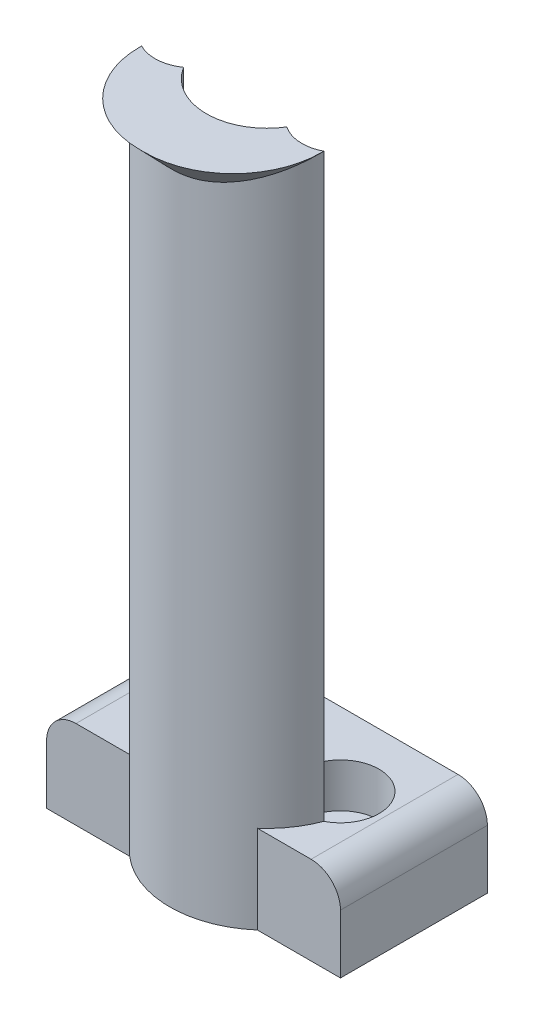
ISO-10303-21;
HEADER;
FILE_DESCRIPTION(('STEP AP214'),'2;1');
FILE_NAME('part.step','',(''),(''),'','','');
FILE_SCHEMA(('AUTOMOTIVE_DESIGN { 1 0 10303 214 1 1 1 1 }'));
ENDSEC;
DATA;
#1=APPLICATION_CONTEXT('core data for automotive mechanical design processes');
#2=APPLICATION_PROTOCOL_DEFINITION('international standard','automotive_design',2000,#1);
#3=PRODUCT_CONTEXT('',#1,'mechanical');
#4=PRODUCT('Part','Part','',(#3));
#5=PRODUCT_RELATED_PRODUCT_CATEGORY('part','',(#4));
#6=PRODUCT_DEFINITION_FORMATION('','',#4);
#7=PRODUCT_DEFINITION_CONTEXT('part definition',#1,'design');
#8=PRODUCT_DEFINITION('design','',#6,#7);
#9=PRODUCT_DEFINITION_SHAPE('','',#8);
#10=(LENGTH_UNIT() NAMED_UNIT(*) SI_UNIT(.MILLI.,.METRE.));
#11=(NAMED_UNIT(*) PLANE_ANGLE_UNIT() SI_UNIT($,.RADIAN.));
#12=(NAMED_UNIT(*) SI_UNIT($,.STERADIAN.) SOLID_ANGLE_UNIT());
#13=UNCERTAINTY_MEASURE_WITH_UNIT(LENGTH_MEASURE(1.E-05),#10,'distance_accuracy_value','');
#14=(GEOMETRIC_REPRESENTATION_CONTEXT(3) GLOBAL_UNCERTAINTY_ASSIGNED_CONTEXT((#13)) GLOBAL_UNIT_ASSIGNED_CONTEXT((#10,
#11,#12)) REPRESENTATION_CONTEXT('',''));
#15=CARTESIAN_POINT('',(0.,0.,0.));
#16=DIRECTION('',(0.,0.,1.));
#17=DIRECTION('',(1.,0.,0.));
#18=AXIS2_PLACEMENT_3D('',#15,#16,#17);
#19=CARTESIAN_POINT('',(-20.,12.,10.));
#20=DIRECTION('',(0.,0.,-1.));
#21=DIRECTION('',(-1.,0.,0.));
#22=AXIS2_PLACEMENT_3D('',#19,#20,#21);
#23=PLANE('',#22);
#24=DIRECTION('',(1.,0.,0.));
#25=VECTOR('',#24,1.);
#26=CARTESIAN_POINT('',(-20.,12.,10.));
#27=LINE('',#26,#25);
#28=CARTESIAN_POINT('',(-16.,12.,10.));
#29=VERTEX_POINT('',#28);
#30=CARTESIAN_POINT('',(-8.69266932535685,12.,10.));
#31=VERTEX_POINT('',#30);
#32=EDGE_CURVE('E255',#29,#31,#27,.T.);
#33=ORIENTED_EDGE('',*,*,#32,.F.);
#34=CARTESIAN_POINT('',(-16.,8.,10.));
#35=DIRECTION('',(0.,0.,-1.));
#36=DIRECTION('',(-1.,0.,0.));
#37=AXIS2_PLACEMENT_3D('',#34,#35,#36);
#38=CIRCLE('',#37,4.);
#39=CARTESIAN_POINT('',(-20.,8.,10.));
#40=VERTEX_POINT('',#39);
#41=EDGE_CURVE('E282',#29,#40,#38,.F.);
#42=ORIENTED_EDGE('',*,*,#41,.T.);
#43=DIRECTION('',(0.,-1.,0.));
#44=VECTOR('',#43,1.);
#45=CARTESIAN_POINT('',(-20.,12.,10.));
#46=LINE('',#45,#44);
#47=CARTESIAN_POINT('',(-20.,0.,10.));
#48=VERTEX_POINT('',#47);
#49=EDGE_CURVE('E270',#40,#48,#46,.T.);
#50=ORIENTED_EDGE('',*,*,#49,.T.);
#51=DIRECTION('',(1.,0.,0.));
#52=VECTOR('',#51,1.);
#53=CARTESIAN_POINT('',(-20.,0.,10.));
#54=LINE('',#53,#52);
#55=CARTESIAN_POINT('',(-8.69266932535685,0.,10.));
#56=VERTEX_POINT('',#55);
#57=EDGE_CURVE('E254',#48,#56,#54,.T.);
#58=ORIENTED_EDGE('',*,*,#57,.T.);
#59=DIRECTION('',(0.,1.,0.));
#60=VECTOR('',#59,1.);
#61=CARTESIAN_POINT('',(-8.69266932535685,-26.3568345823297,10.));
#62=LINE('',#61,#60);
#63=EDGE_CURVE('E215',#56,#31,#62,.T.);
#64=ORIENTED_EDGE('',*,*,#63,.T.);
#65=EDGE_LOOP('',(#33,#42,#50,#58,#64));
#66=FACE_BOUND('',#65,.T.);
#67=ADVANCED_FACE('F35',(#66),#23,.F.);
#68=CARTESIAN_POINT('',(20.,12.,10.));
#69=DIRECTION('',(-1.,0.,0.));
#70=DIRECTION('',(0.,0.,1.));
#71=AXIS2_PLACEMENT_3D('',#68,#69,#70);
#72=PLANE('',#71);
#73=DIRECTION('',(0.,-1.,0.));
#74=VECTOR('',#73,1.);
#75=CARTESIAN_POINT('',(20.,12.,-10.));
#76=LINE('',#75,#74);
#77=CARTESIAN_POINT('',(20.,8.,-10.));
#78=VERTEX_POINT('',#77);
#79=CARTESIAN_POINT('',(20.,0.,-10.));
#80=VERTEX_POINT('',#79);
#81=EDGE_CURVE('E274',#78,#80,#76,.T.);
#82=ORIENTED_EDGE('',*,*,#81,.F.);
#83=DIRECTION('',(0.,0.,-1.));
#84=VECTOR('',#83,1.);
#85=CARTESIAN_POINT('',(20.,8.,10.));
#86=LINE('',#85,#84);
#87=CARTESIAN_POINT('',(20.,8.,10.));
#88=VERTEX_POINT('',#87);
#89=EDGE_CURVE('E55',#78,#88,#86,.F.);
#90=ORIENTED_EDGE('',*,*,#89,.T.);
#91=DIRECTION('',(0.,-1.,0.));
#92=VECTOR('',#91,1.);
#93=CARTESIAN_POINT('',(20.,12.,10.));
#94=LINE('',#93,#92);
#95=CARTESIAN_POINT('',(20.,0.,10.));
#96=VERTEX_POINT('',#95);
#97=EDGE_CURVE('E257',#88,#96,#94,.T.);
#98=ORIENTED_EDGE('',*,*,#97,.T.);
#99=DIRECTION('',(0.,0.,-1.));
#100=VECTOR('',#99,1.);
#101=CARTESIAN_POINT('',(20.,0.,10.));
#102=LINE('',#101,#100);
#103=EDGE_CURVE('E249',#96,#80,#102,.T.);
#104=ORIENTED_EDGE('',*,*,#103,.T.);
#105=EDGE_LOOP('',(#82,#90,#98,#104));
#106=FACE_BOUND('',#105,.T.);
#107=ADVANCED_FACE('F323',(#106),#72,.F.);
#108=CARTESIAN_POINT('',(-20.,12.,-10.));
#109=DIRECTION('',(0.,0.,1.));
#110=DIRECTION('',(1.,0.,0.));
#111=AXIS2_PLACEMENT_3D('',#108,#109,#110);
#112=PLANE('',#111);
#113=DIRECTION('',(0.,-1.,0.));
#114=VECTOR('',#113,1.);
#115=CARTESIAN_POINT('',(-20.,12.,-10.));
#116=LINE('',#115,#114);
#117=CARTESIAN_POINT('',(-20.,8.,-10.));
#118=VERTEX_POINT('',#117);
#119=CARTESIAN_POINT('',(-20.,0.,-10.));
#120=VERTEX_POINT('',#119);
#121=EDGE_CURVE('E272',#118,#120,#116,.T.);
#122=ORIENTED_EDGE('',*,*,#121,.F.);
#123=CARTESIAN_POINT('',(-16.,8.,-10.));
#124=DIRECTION('',(0.,0.,1.));
#125=DIRECTION('',(1.,0.,0.));
#126=AXIS2_PLACEMENT_3D('',#123,#124,#125);
#127=CIRCLE('',#126,4.);
#128=CARTESIAN_POINT('',(-16.,12.,-10.));
#129=VERTEX_POINT('',#128);
#130=EDGE_CURVE('E287',#118,#129,#127,.F.);
#131=ORIENTED_EDGE('',*,*,#130,.T.);
#132=DIRECTION('',(-1.,0.,0.));
#133=VECTOR('',#132,1.);
#134=CARTESIAN_POINT('',(-20.,12.,-10.));
#135=LINE('',#134,#133);
#136=CARTESIAN_POINT('',(16.,12.,-10.));
#137=VERTEX_POINT('',#136);
#138=EDGE_CURVE('E250',#137,#129,#135,.T.);
#139=ORIENTED_EDGE('',*,*,#138,.F.);
#140=CARTESIAN_POINT('',(16.,8.,-10.));
#141=DIRECTION('',(0.,0.,1.));
#142=DIRECTION('',(1.,0.,0.));
#143=AXIS2_PLACEMENT_3D('',#140,#141,#142);
#144=CIRCLE('',#143,4.);
#145=EDGE_CURVE('E63',#137,#78,#144,.F.);
#146=ORIENTED_EDGE('',*,*,#145,.T.);
#147=ORIENTED_EDGE('',*,*,#81,.T.);
#148=DIRECTION('',(-1.,0.,0.));
#149=VECTOR('',#148,1.);
#150=CARTESIAN_POINT('',(-20.,0.,-10.));
#151=LINE('',#150,#149);
#152=EDGE_CURVE('E260',#80,#120,#151,.T.);
#153=ORIENTED_EDGE('',*,*,#152,.T.);
#154=EDGE_LOOP('',(#122,#131,#139,#146,#147,#153));
#155=FACE_BOUND('',#154,.T.);
#156=ADVANCED_FACE('F330',(#155),#112,.F.);
#157=CARTESIAN_POINT('',(-20.,12.,10.));
#158=DIRECTION('',(1.,0.,0.));
#159=DIRECTION('',(0.,0.,-1.));
#160=AXIS2_PLACEMENT_3D('',#157,#158,#159);
#161=PLANE('',#160);
#162=ORIENTED_EDGE('',*,*,#49,.F.);
#163=DIRECTION('',(0.,0.,1.));
#164=VECTOR('',#163,1.);
#165=CARTESIAN_POINT('',(-20.,8.,10.));
#166=LINE('',#165,#164);
#167=EDGE_CURVE('E284',#40,#118,#166,.F.);
#168=ORIENTED_EDGE('',*,*,#167,.T.);
#169=ORIENTED_EDGE('',*,*,#121,.T.);
#170=DIRECTION('',(0.,0.,1.));
#171=VECTOR('',#170,1.);
#172=CARTESIAN_POINT('',(-20.,0.,10.));
#173=LINE('',#172,#171);
#174=EDGE_CURVE('E263',#120,#48,#173,.T.);
#175=ORIENTED_EDGE('',*,*,#174,.T.);
#176=EDGE_LOOP('',(#162,#168,#169,#175));
#177=FACE_BOUND('',#176,.T.);
#178=ADVANCED_FACE('F337',(#177),#161,.F.);
#179=ORIENTED_EDGE('',*,*,#97,.F.);
#180=CARTESIAN_POINT('',(16.,8.,10.));
#181=DIRECTION('',(0.,0.,-1.));
#182=DIRECTION('',(-1.,0.,0.));
#183=AXIS2_PLACEMENT_3D('',#180,#181,#182);
#184=CIRCLE('',#183,4.);
#185=CARTESIAN_POINT('',(16.,12.,10.));
#186=VERTEX_POINT('',#185);
#187=EDGE_CURVE('E290',#88,#186,#184,.F.);
#188=ORIENTED_EDGE('',*,*,#187,.T.);
#189=CARTESIAN_POINT('',(8.69266932535685,12.,10.));
#190=VERTEX_POINT('',#189);
#191=EDGE_CURVE('E253',#190,#186,#27,.T.);
#192=ORIENTED_EDGE('',*,*,#191,.F.);
#193=DIRECTION('',(0.,1.,0.));
#194=VECTOR('',#193,1.);
#195=CARTESIAN_POINT('',(8.69266932535685,-26.3568345823297,10.));
#196=LINE('',#195,#194);
#197=CARTESIAN_POINT('',(8.69266932535685,0.,10.));
#198=VERTEX_POINT('',#197);
#199=EDGE_CURVE('E219',#190,#198,#196,.F.);
#200=ORIENTED_EDGE('',*,*,#199,.T.);
#201=EDGE_CURVE('E266',#198,#96,#54,.T.);
#202=ORIENTED_EDGE('',*,*,#201,.T.);
#203=EDGE_LOOP('',(#179,#188,#192,#200,#202));
#204=FACE_BOUND('',#203,.T.);
#205=ADVANCED_FACE('F326',(#204),#23,.F.);
#206=CARTESIAN_POINT('',(0.,12.,0.));
#207=DIRECTION('',(0.,-1.,0.));
#208=DIRECTION('',(0.,0.,-1.));
#209=AXIS2_PLACEMENT_3D('',#206,#207,#208);
#210=PLANE('',#209);
#211=ORIENTED_EDGE('',*,*,#138,.T.);
#212=DIRECTION('',(0.,0.,1.));
#213=VECTOR('',#212,1.);
#214=CARTESIAN_POINT('',(-16.,12.,0.));
#215=LINE('',#214,#213);
#216=EDGE_CURVE('E279',#129,#29,#215,.T.);
#217=ORIENTED_EDGE('',*,*,#216,.T.);
#218=ORIENTED_EDGE('',*,*,#32,.T.);
#219=CARTESIAN_POINT('',(0.,12.,0.));
#220=DIRECTION('',(0.,-1.,0.));
#221=DIRECTION('',(0.,0.,-1.));
#222=AXIS2_PLACEMENT_3D('',#219,#220,#221);
#223=CIRCLE('',#222,13.25);
#224=CARTESIAN_POINT('',(-12.4,12.,4.669314724882));
#225=VERTEX_POINT('',#224);
#226=EDGE_CURVE('E212',#31,#225,#223,.T.);
#227=ORIENTED_EDGE('',*,*,#226,.T.);
#228=CARTESIAN_POINT('',(-10.,12.,0.));
#229=DIRECTION('',(0.,1.,0.));
#230=DIRECTION('',(0.,0.,1.));
#231=AXIS2_PLACEMENT_3D('',#228,#229,#230);
#232=CIRCLE('',#231,5.24999999999999);
#233=CARTESIAN_POINT('',(-7.025,12.,4.32572248300789));
#234=VERTEX_POINT('',#233);
#235=EDGE_CURVE('E237',#234,#225,#232,.T.);
#236=ORIENTED_EDGE('',*,*,#235,.F.);
#237=CARTESIAN_POINT('',(0.,12.,0.));
#238=DIRECTION('',(0.,-1.,0.));
#239=DIRECTION('',(0.,0.,-1.));
#240=AXIS2_PLACEMENT_3D('',#237,#238,#239);
#241=CIRCLE('',#240,8.25);
#242=CARTESIAN_POINT('',(7.025,12.,4.32572248300789));
#243=VERTEX_POINT('',#242);
#244=EDGE_CURVE('E222',#234,#243,#241,.F.);
#245=ORIENTED_EDGE('',*,*,#244,.T.);
#246=CARTESIAN_POINT('',(10.,12.,0.));
#247=DIRECTION('',(0.,1.,0.));
#248=DIRECTION('',(0.,0.,1.));
#249=AXIS2_PLACEMENT_3D('',#246,#247,#248);
#250=CIRCLE('',#249,5.24999999999999);
#251=CARTESIAN_POINT('',(12.4,12.,4.66931472488201));
#252=VERTEX_POINT('',#251);
#253=EDGE_CURVE('E225',#252,#243,#250,.T.);
#254=ORIENTED_EDGE('',*,*,#253,.F.);
#255=EDGE_CURVE('E216',#252,#190,#223,.T.);
#256=ORIENTED_EDGE('',*,*,#255,.T.);
#257=ORIENTED_EDGE('',*,*,#191,.T.);
#258=DIRECTION('',(0.,0.,-1.));
#259=VECTOR('',#258,1.);
#260=CARTESIAN_POINT('',(16.,12.,0.));
#261=LINE('',#260,#259);
#262=EDGE_CURVE('E276',#186,#137,#261,.T.);
#263=ORIENTED_EDGE('',*,*,#262,.T.);
#264=EDGE_LOOP('',(#211,#217,#218,#227,#236,#245,#254,#256,#257,#263));
#265=FACE_BOUND('',#264,.T.);
#266=ADVANCED_FACE('F336',(#265),#210,.F.);
#267=CARTESIAN_POINT('',(0.,0.,0.));
#268=DIRECTION('',(0.,-1.,0.));
#269=DIRECTION('',(0.,0.,-1.));
#270=AXIS2_PLACEMENT_3D('',#267,#268,#269);
#271=PLANE('',#270);
#272=ORIENTED_EDGE('',*,*,#201,.F.);
#273=CARTESIAN_POINT('',(0.,0.,0.));
#274=DIRECTION('',(0.,-1.,0.));
#275=DIRECTION('',(0.,0.,-1.));
#276=AXIS2_PLACEMENT_3D('',#273,#274,#275);
#277=CIRCLE('',#276,13.25);
#278=EDGE_CURVE('E202',#56,#198,#277,.F.);
#279=ORIENTED_EDGE('',*,*,#278,.F.);
#280=ORIENTED_EDGE('',*,*,#57,.F.);
#281=ORIENTED_EDGE('',*,*,#174,.F.);
#282=ORIENTED_EDGE('',*,*,#152,.F.);
#283=ORIENTED_EDGE('',*,*,#103,.F.);
#284=EDGE_LOOP('',(#272,#279,#280,#281,#282,#283));
#285=FACE_BOUND('',#284,.T.);
#286=CARTESIAN_POINT('',(10.,0.,0.));
#287=DIRECTION('',(0.,-1.,0.));
#288=DIRECTION('',(0.,0.,-1.));
#289=AXIS2_PLACEMENT_3D('',#286,#287,#288);
#290=CIRCLE('',#289,2.75);
#291=CARTESIAN_POINT('',(10.,0.,-2.75));
#292=VERTEX_POINT('',#291);
#293=EDGE_CURVE('E234',#292,#292,#290,.T.);
#294=ORIENTED_EDGE('',*,*,#293,.F.);
#295=EDGE_LOOP('',(#294));
#296=FACE_BOUND('',#295,.T.);
#297=CARTESIAN_POINT('',(-10.,0.,0.));
#298=DIRECTION('',(0.,-1.,0.));
#299=DIRECTION('',(0.,0.,-1.));
#300=AXIS2_PLACEMENT_3D('',#297,#298,#299);
#301=CIRCLE('',#300,2.75);
#302=CARTESIAN_POINT('',(-10.,0.,-2.75));
#303=VERTEX_POINT('',#302);
#304=EDGE_CURVE('E246',#303,#303,#301,.T.);
#305=ORIENTED_EDGE('',*,*,#304,.F.);
#306=EDGE_LOOP('',(#305));
#307=FACE_BOUND('',#306,.T.);
#308=ADVANCED_FACE('F343',(#285,#296,#307),#271,.T.);
#309=CARTESIAN_POINT('',(-10.,12.,0.));
#310=DIRECTION('',(0.,1.,0.));
#311=DIRECTION('',(0.,0.,1.));
#312=AXIS2_PLACEMENT_3D('',#309,#310,#311);
#313=CYLINDRICAL_SURFACE('',#312,2.75);
#314=CARTESIAN_POINT('',(-10.,6.,0.));
#315=DIRECTION('',(0.,1.,0.));
#316=DIRECTION('',(0.,0.,1.));
#317=AXIS2_PLACEMENT_3D('',#314,#315,#316);
#318=CIRCLE('',#317,2.75000000000001);
#319=CARTESIAN_POINT('',(-10.,6.,2.75000000000001));
#320=VERTEX_POINT('',#319);
#321=EDGE_CURVE('E243',#320,#320,#318,.T.);
#322=ORIENTED_EDGE('',*,*,#321,.T.);
#323=EDGE_LOOP('',(#322));
#324=FACE_BOUND('',#323,.T.);
#325=ORIENTED_EDGE('',*,*,#304,.T.);
#326=EDGE_LOOP('',(#325));
#327=FACE_BOUND('',#326,.T.);
#328=ADVANCED_FACE('F370',(#324,#327),#313,.F.);
#329=CARTESIAN_POINT('',(-7.24999999999999,6.,0.));
#330=DIRECTION('',(0.,-1.,0.));
#331=DIRECTION('',(0.,0.,-1.));
#332=AXIS2_PLACEMENT_3D('',#329,#330,#331);
#333=PLANE('',#332);
#334=ORIENTED_EDGE('',*,*,#321,.F.);
#335=EDGE_LOOP('',(#334));
#336=FACE_BOUND('',#335,.T.);
#337=CARTESIAN_POINT('',(-10.,6.,0.));
#338=DIRECTION('',(0.,1.,0.));
#339=DIRECTION('',(0.,0.,1.));
#340=AXIS2_PLACEMENT_3D('',#337,#338,#339);
#341=CIRCLE('',#340,5.24999999999999);
#342=CARTESIAN_POINT('',(-10.,6.,5.24999999999999));
#343=VERTEX_POINT('',#342);
#344=EDGE_CURVE('E240',#343,#343,#341,.T.);
#345=ORIENTED_EDGE('',*,*,#344,.T.);
#346=EDGE_LOOP('',(#345));
#347=FACE_BOUND('',#346,.T.);
#348=ADVANCED_FACE('F376',(#336,#347),#333,.F.);
#349=CARTESIAN_POINT('',(-10.,12.,0.));
#350=DIRECTION('',(0.,1.,0.));
#351=DIRECTION('',(0.,0.,1.));
#352=AXIS2_PLACEMENT_3D('',#349,#350,#351);
#353=CYLINDRICAL_SURFACE('',#352,5.24999999999999);
#354=ORIENTED_EDGE('',*,*,#235,.T.);
#355=DIRECTION('',(0.,1.,0.));
#356=VECTOR('',#355,1.);
#357=CARTESIAN_POINT('',(-12.4,-26.3568345823297,4.669314724882));
#358=LINE('',#357,#356);
#359=CARTESIAN_POINT('',(-12.4,91.,4.669314724882));
#360=VERTEX_POINT('',#359);
#361=EDGE_CURVE('E205',#225,#360,#358,.T.);
#362=ORIENTED_EDGE('',*,*,#361,.T.);
#363=CARTESIAN_POINT('',(-10.,91.,0.));
#364=DIRECTION('',(0.,-1.,0.));
#365=DIRECTION('',(0.,0.,1.));
#366=AXIS2_PLACEMENT_3D('',#363,#364,#365);
#367=CIRCLE('',#366,5.24999999999999);
#368=CARTESIAN_POINT('',(-7.025,91.,4.32572248300789));
#369=VERTEX_POINT('',#368);
#370=EDGE_CURVE('E198',#369,#360,#367,.T.);
#371=ORIENTED_EDGE('',*,*,#370,.F.);
#372=DIRECTION('',(0.,1.,0.));
#373=VECTOR('',#372,1.);
#374=CARTESIAN_POINT('',(-7.025,-26.3568345823297,4.32572248300789));
#375=LINE('',#374,#373);
#376=EDGE_CURVE('E201',#234,#369,#375,.T.);
#377=ORIENTED_EDGE('',*,*,#376,.F.);
#378=EDGE_LOOP('',(#354,#362,#371,#377));
#379=FACE_BOUND('',#378,.T.);
#380=ORIENTED_EDGE('',*,*,#344,.F.);
#381=EDGE_LOOP('',(#380));
#382=FACE_BOUND('',#381,.T.);
#383=ADVANCED_FACE('F382',(#379,#382),#353,.F.);
#384=CARTESIAN_POINT('',(10.,12.,0.));
#385=DIRECTION('',(0.,1.,0.));
#386=DIRECTION('',(0.,0.,1.));
#387=AXIS2_PLACEMENT_3D('',#384,#385,#386);
#388=CYLINDRICAL_SURFACE('',#387,2.75);
#389=CARTESIAN_POINT('',(10.,6.,0.));
#390=DIRECTION('',(0.,1.,0.));
#391=DIRECTION('',(0.,0.,1.));
#392=AXIS2_PLACEMENT_3D('',#389,#390,#391);
#393=CIRCLE('',#392,2.75000000000001);
#394=CARTESIAN_POINT('',(10.,6.,2.75000000000001));
#395=VERTEX_POINT('',#394);
#396=EDGE_CURVE('E231',#395,#395,#393,.T.);
#397=ORIENTED_EDGE('',*,*,#396,.T.);
#398=EDGE_LOOP('',(#397));
#399=FACE_BOUND('',#398,.T.);
#400=ORIENTED_EDGE('',*,*,#293,.T.);
#401=EDGE_LOOP('',(#400));
#402=FACE_BOUND('',#401,.T.);
#403=ADVANCED_FACE('F388',(#399,#402),#388,.F.);
#404=CARTESIAN_POINT('',(12.75,6.,0.));
#405=DIRECTION('',(0.,-1.,0.));
#406=DIRECTION('',(0.,0.,-1.));
#407=AXIS2_PLACEMENT_3D('',#404,#405,#406);
#408=PLANE('',#407);
#409=ORIENTED_EDGE('',*,*,#396,.F.);
#410=EDGE_LOOP('',(#409));
#411=FACE_BOUND('',#410,.T.);
#412=CARTESIAN_POINT('',(10.,6.,0.));
#413=DIRECTION('',(0.,1.,0.));
#414=DIRECTION('',(0.,0.,1.));
#415=AXIS2_PLACEMENT_3D('',#412,#413,#414);
#416=CIRCLE('',#415,5.24999999999999);
#417=CARTESIAN_POINT('',(10.,6.,5.24999999999999));
#418=VERTEX_POINT('',#417);
#419=EDGE_CURVE('E228',#418,#418,#416,.T.);
#420=ORIENTED_EDGE('',*,*,#419,.T.);
#421=EDGE_LOOP('',(#420));
#422=FACE_BOUND('',#421,.T.);
#423=ADVANCED_FACE('F392',(#411,#422),#408,.F.);
#424=CARTESIAN_POINT('',(10.,12.,0.));
#425=DIRECTION('',(0.,1.,0.));
#426=DIRECTION('',(0.,0.,1.));
#427=AXIS2_PLACEMENT_3D('',#424,#425,#426);
#428=CYLINDRICAL_SURFACE('',#427,5.24999999999999);
#429=ORIENTED_EDGE('',*,*,#419,.F.);
#430=EDGE_LOOP('',(#429));
#431=FACE_BOUND('',#430,.T.);
#432=ORIENTED_EDGE('',*,*,#253,.T.);
#433=DIRECTION('',(0.,1.,0.));
#434=VECTOR('',#433,1.);
#435=CARTESIAN_POINT('',(7.025,-26.3568345823297,4.32572248300789));
#436=LINE('',#435,#434);
#437=CARTESIAN_POINT('',(7.025,91.,4.32572248300789));
#438=VERTEX_POINT('',#437);
#439=EDGE_CURVE('E207',#243,#438,#436,.T.);
#440=ORIENTED_EDGE('',*,*,#439,.T.);
#441=CARTESIAN_POINT('',(10.,91.,0.));
#442=DIRECTION('',(0.,-1.,0.));
#443=DIRECTION('',(0.,0.,1.));
#444=AXIS2_PLACEMENT_3D('',#441,#442,#443);
#445=CIRCLE('',#444,5.25);
#446=CARTESIAN_POINT('',(12.4,91.,4.66931472488201));
#447=VERTEX_POINT('',#446);
#448=EDGE_CURVE('E193',#447,#438,#445,.T.);
#449=ORIENTED_EDGE('',*,*,#448,.F.);
#450=DIRECTION('',(0.,1.,0.));
#451=VECTOR('',#450,1.);
#452=CARTESIAN_POINT('',(12.4,-26.3568345823297,4.66931472488201));
#453=LINE('',#452,#451);
#454=EDGE_CURVE('E204',#252,#447,#453,.T.);
#455=ORIENTED_EDGE('',*,*,#454,.F.);
#456=EDGE_LOOP('',(#432,#440,#449,#455));
#457=FACE_BOUND('',#456,.T.);
#458=ADVANCED_FACE('F396',(#431,#457),#428,.F.);
#459=CARTESIAN_POINT('',(0.,-26.3568345823297,0.));
#460=DIRECTION('',(0.,1.,0.));
#461=DIRECTION('',(0.,0.,1.));
#462=AXIS2_PLACEMENT_3D('',#459,#460,#461);
#463=CYLINDRICAL_SURFACE('',#462,8.25);
#464=ORIENTED_EDGE('',*,*,#244,.F.);
#465=ORIENTED_EDGE('',*,*,#376,.T.);
#466=CARTESIAN_POINT('',(0.,91.,0.));
#467=DIRECTION('',(0.,-1.,0.));
#468=DIRECTION('',(0.,0.,1.));
#469=AXIS2_PLACEMENT_3D('',#466,#467,#468);
#470=CIRCLE('',#469,8.25);
#471=EDGE_CURVE('E195',#438,#369,#470,.T.);
#472=ORIENTED_EDGE('',*,*,#471,.F.);
#473=ORIENTED_EDGE('',*,*,#439,.F.);
#474=EDGE_LOOP('',(#464,#465,#472,#473));
#475=FACE_BOUND('',#474,.T.);
#476=ADVANCED_FACE('F320',(#475),#463,.F.);
#477=CARTESIAN_POINT('',(0.,-26.3568345823297,0.));
#478=DIRECTION('',(0.,1.,0.));
#479=DIRECTION('',(0.,0.,1.));
#480=AXIS2_PLACEMENT_3D('',#477,#478,#479);
#481=CYLINDRICAL_SURFACE('',#480,13.25);
#482=CARTESIAN_POINT('',(0.,78.159424108997,0.));
#483=DIRECTION('',(-0.71933980033865,-0.694658370458998,0.));
#484=DIRECTION('',(-0.694658370458998,0.71933980033865,0.));
#485=AXIS2_PLACEMENT_3D('',#482,#483,#484);
#486=ELLIPSE('',#485,19.0741241500409,13.25);
#487=CARTESIAN_POINT('',(-12.2703911918081,90.865786150183,4.99999999999992));
#488=VERTEX_POINT('',#487);
#489=EDGE_CURVE('E191',#360,#488,#486,.F.);
#490=ORIENTED_EDGE('',*,*,#489,.F.);
#491=ORIENTED_EDGE('',*,*,#361,.F.);
#492=ORIENTED_EDGE('',*,*,#226,.F.);
#493=ORIENTED_EDGE('',*,*,#63,.F.);
#494=ORIENTED_EDGE('',*,*,#278,.T.);
#495=ORIENTED_EDGE('',*,*,#199,.F.);
#496=ORIENTED_EDGE('',*,*,#255,.F.);
#497=ORIENTED_EDGE('',*,*,#454,.T.);
#498=CARTESIAN_POINT('',(0.,78.159424108997,0.));
#499=DIRECTION('',(0.71933980033865,-0.694658370458998,0.));
#500=DIRECTION('',(0.694658370458998,0.71933980033865,0.));
#501=AXIS2_PLACEMENT_3D('',#498,#499,#500);
#502=ELLIPSE('',#501,19.0741241500409,13.25);
#503=CARTESIAN_POINT('',(12.2703911918081,90.865786150183,4.99999999999993));
#504=VERTEX_POINT('',#503);
#505=EDGE_CURVE('E169',#504,#447,#502,.F.);
#506=ORIENTED_EDGE('',*,*,#505,.F.);
#507=CARTESIAN_POINT('',(0.399799999999921,87.1105138956851,13.243966926869));
#508=CARTESIAN_POINT('',(0.558324091708814,87.1055520191043,13.2391825488787));
#509=CARTESIAN_POINT('',(0.716799216609089,87.102382043858,13.2315481782029));
#510=CARTESIAN_POINT('',(1.03340176444357,87.0996335516413,13.2105923653668));
#511=CARTESIAN_POINT('',(1.19152919261621,87.1000549801863,13.1972710094856));
#512=CARTESIAN_POINT('',(1.66483357357226,87.1067150515328,13.1488148294522));
#513=CARTESIAN_POINT('',(1.9791229766649,87.118343524771,13.1051821310407));
#514=CARTESIAN_POINT('',(2.60142893270136,87.1555699723033,12.9959394158403));
#515=CARTESIAN_POINT('',(2.90946811579138,87.1811016485311,12.9304342677878));
#516=CARTESIAN_POINT('',(3.51882382802508,87.245405147456,12.7780674910788));
#517=CARTESIAN_POINT('',(3.82013994879676,87.2841777721145,12.6912045689404));
#518=CARTESIAN_POINT('',(4.41687688985498,87.3744048106561,12.4961248203904));
#519=CARTESIAN_POINT('',(4.71222012046359,87.4259703527478,12.3877226256167));
#520=CARTESIAN_POINT('',(5.29257528690199,87.5404221443415,12.151105155208));
#521=CARTESIAN_POINT('',(5.57758713427715,87.6033084907418,12.0228897099867));
#522=CARTESIAN_POINT('',(6.13617245035596,87.7391920704133,11.7476348209863));
#523=CARTESIAN_POINT('',(6.40973567308981,87.8121981186279,11.6005789744959));
#524=CARTESIAN_POINT('',(6.94412595619106,87.9670226000189,11.2888155043674));
#525=CARTESIAN_POINT('',(7.20494814041608,88.048844369261,11.124101198492));
#526=CARTESIAN_POINT('',(7.73876950801876,88.2287922860128,10.7605118226826));
#527=CARTESIAN_POINT('',(8.01028974533299,88.327730133939,10.5598659470159));
#528=CARTESIAN_POINT('',(8.5356040523229,88.5332698993245,10.1399745949387));
#529=CARTESIAN_POINT('',(8.78939142017092,88.6398746838102,9.92072215508886));
#530=CARTESIAN_POINT('',(9.27832176410478,88.8593606513596,9.46503912243591));
#531=CARTESIAN_POINT('',(9.51345718229884,88.9722443474787,9.22860163975373));
#532=CARTESIAN_POINT('',(9.96414846748466,89.2029890746693,8.74006214340449));
#533=CARTESIAN_POINT('',(10.1797056221818,89.3208497776443,8.48796116179953));
#534=CARTESIAN_POINT('',(10.5806433562613,89.5546800145647,7.98195574312662));
#535=CARTESIAN_POINT('',(10.7669765517835,89.6704679920065,7.72872086888064));
#536=CARTESIAN_POINT('',(11.1206367722573,89.9046799571959,7.2105690400085));
#537=CARTESIAN_POINT('',(11.2879680133274,90.0231033532002,6.94565469498188));
#538=CARTESIAN_POINT('',(11.6027921337934,90.2615958595932,6.40586583183514));
#539=CARTESIAN_POINT('',(11.750326147039,90.3816609680621,6.13101352061806));
#540=CARTESIAN_POINT('',(12.0254657101668,90.6230128045953,5.57205110199347));
#541=CARTESIAN_POINT('',(12.153072529195,90.7442994543367,5.28794158556367));
#542=CARTESIAN_POINT('',(12.2704726869017,90.8658705425676,4.99979999999992));
#543=B_SPLINE_CURVE_WITH_KNOTS('',3,(#507,#508,#509,#510,#511,#512,#513,#514,#515,#516,#517,
#518,#519,#520,#521,#522,#523,#524,#525,#526,#527,#528,#529,#530,#531,#532,#533,#534,#535,#536,
#537,#538,#539,#540,#541,#542),.UNSPECIFIED.,.F.,.F.,(4,2,2,2,2,2,2,2,2,2,2,2,2,2,2,2,2,4),(0.,
0.47594781679873,0.951888413090244,1.90319986985285,2.8500141799263,3.79688584565031,
4.75228984071221,5.70770201376485,6.66395170721927,7.6205645464051,8.67492436442308,
9.72968052777649,10.7848619248739,11.8399738700409,12.8443530241528,13.8485088912484,
14.8505449459469,15.8525171557648),.UNSPECIFIED.);
#544=CARTESIAN_POINT('',(0.399999999999921,87.1105076396287,13.2439608878915));
#545=VERTEX_POINT('',#544);
#546=EDGE_CURVE('E160',#545,#504,#543,.T.);
#547=ORIENTED_EDGE('',*,*,#546,.F.);
#548=CARTESIAN_POINT('',(0.,73.3959846655604,0.));
#549=DIRECTION('',(0.,-0.694658370458998,0.71933980033865));
#550=DIRECTION('',(0.,0.71933980033865,0.694658370458998));
#551=AXIS2_PLACEMENT_3D('',#548,#549,#550);
#552=ELLIPSE('',#551,19.0741241500409,13.25);
#553=CARTESIAN_POINT('',(-0.399999999999944,87.1105076396287,13.2439608878915));
#554=VERTEX_POINT('',#553);
#555=EDGE_CURVE('E48',#554,#545,#552,.F.);
#556=ORIENTED_EDGE('',*,*,#555,.F.);
#557=CARTESIAN_POINT('',(-12.2704726869017,90.8658705425676,4.99979999999992));
#558=CARTESIAN_POINT('',(-12.1214541456284,90.7115663924977,5.36556836791856));
#559=CARTESIAN_POINT('',(-11.9559770895717,90.5576954713956,5.72483396493369));
#560=CARTESIAN_POINT('',(-11.593099927883,90.2521839825085,6.42798346990965));
#561=CARTESIAN_POINT('',(-11.3956918632335,90.1005439811024,6.77186351556683));
#562=CARTESIAN_POINT('',(-10.9690180489433,89.8002299664274,7.44326062629925));
#563=CARTESIAN_POINT('',(-10.7396064031928,89.6515733200376,7.77069284553359));
#564=CARTESIAN_POINT('',(-10.2508348198316,89.3596769796942,8.4049486338411));
#565=CARTESIAN_POINT('',(-9.99147725790575,89.2164368572293,8.71177383467048));
#566=CARTESIAN_POINT('',(-9.44590122392758,88.9382408020494,9.30039774688502));
#567=CARTESIAN_POINT('',(-9.15987274192868,88.8032361358912,9.5823492436703));
#568=CARTESIAN_POINT('',(-8.56094383528831,88.5427010510558,10.1210174696618));
#569=CARTESIAN_POINT('',(-8.24804195556642,88.4171711460889,10.3777328308224));
#570=CARTESIAN_POINT('',(-7.59737920801858,88.1782548198263,10.8630917446748));
#571=CARTESIAN_POINT('',(-7.25965038699861,88.0648531920433,11.0917705037364));
#572=CARTESIAN_POINT('',(-6.73591719441096,87.9058984663615,11.411915600383));
#573=CARTESIAN_POINT('',(-6.55848801070206,87.8547727857831,11.5148158982241));
#574=CARTESIAN_POINT('',(-6.19810438951717,87.7565695521559,11.7127399425905));
#575=CARTESIAN_POINT('',(-6.01514794198464,87.7094934963411,11.8077607754434));
#576=CARTESIAN_POINT('',(-5.49142195959421,87.5828745266341,12.0643503950045));
#577=CARTESIAN_POINT('',(-5.14464084592193,87.508480681552,12.2163610831856));
#578=CARTESIAN_POINT('',(-4.43650879523137,87.3767277457463,12.4909570955959));
#579=CARTESIAN_POINT('',(-4.07516085423695,87.3193651722234,12.6135484349317));
#580=CARTESIAN_POINT('',(-3.52501460038905,87.2476315036637,12.7739270680679));
#581=CARTESIAN_POINT('',(-3.34047341080429,87.2261201839876,12.8234294774636));
#582=CARTESIAN_POINT('',(-2.96896980140813,87.1880213037821,12.9144983016656));
#583=CARTESIAN_POINT('',(-2.78200797059441,87.1714325681288,12.9560666096611));
#584=CARTESIAN_POINT('',(-2.40621154383738,87.1433488371303,13.0310913395666));
#585=CARTESIAN_POINT('',(-2.21737820799114,87.1318506247602,13.0645528785871));
#586=CARTESIAN_POINT('',(-1.83820866984503,87.1140483061998,13.1232728249086));
#587=CARTESIAN_POINT('',(-1.64787258529499,87.1077437970491,13.1485318685191));
#588=CARTESIAN_POINT('',(-1.28131663671981,87.1006865109364,13.1890854005807));
#589=CARTESIAN_POINT('',(-1.10517390615526,87.0995332342139,13.2050110972527));
#590=CARTESIAN_POINT('',(-0.752633596810258,87.1016862849708,13.2297870151368));
#591=CARTESIAN_POINT('',(-0.576236586608573,87.1049872028382,13.2386457983243));
#592=CARTESIAN_POINT('',(-0.399799999999918,87.1105138956851,13.243966926869));
#593=B_SPLINE_CURVE_WITH_KNOTS('',3,(#557,#558,#559,#560,#561,#562,#563,#564,#565,#566,#567,
#568,#569,#570,#571,#572,#573,#574,#575,#576,#577,#578,#579,#580,#581,#582,#583,#584,#585,#586,
#587,#588,#589,#590,#591,#592),.UNSPECIFIED.,.F.,.F.,(4,2,2,2,2,2,2,2,2,2,2,2,2,2,2,2,2,4),(0.,
1.27175459264282,2.54382666849746,3.82189977656214,5.09987156145027,6.369349237535,
7.63889569383392,8.90683125082268,9.54076353432763,10.1749291979014,11.3307780858916,
12.486390446239,13.0630056965248,13.6394831857482,14.2155958403691,14.7916637923017,
15.3220630663724,15.8518187508273),.UNSPECIFIED.);
#594=EDGE_CURVE('E11',#488,#554,#593,.T.);
#595=ORIENTED_EDGE('',*,*,#594,.F.);
#596=EDGE_LOOP('',(#490,#491,#492,#493,#494,#495,#496,#497,#506,#547,#556,#595));
#597=FACE_BOUND('',#596,.T.);
#598=ADVANCED_FACE('F296',(#597),#481,.T.);
#599=CARTESIAN_POINT('',(5.,91.,0.));
#600=DIRECTION('',(0.,1.,0.));
#601=DIRECTION('',(0.,0.,1.));
#602=AXIS2_PLACEMENT_3D('',#599,#600,#601);
#603=PLANE('',#602);
#604=ORIENTED_EDGE('',*,*,#448,.T.);
#605=ORIENTED_EDGE('',*,*,#471,.T.);
#606=ORIENTED_EDGE('',*,*,#370,.T.);
#607=DIRECTION('',(0.,0.,1.));
#608=VECTOR('',#607,1.);
#609=CARTESIAN_POINT('',(-12.4,91.,4.669314724882));
#610=LINE('',#609,#608);
#611=CARTESIAN_POINT('',(-12.4,91.,4.99999999999992));
#612=VERTEX_POINT('',#611);
#613=EDGE_CURVE('E173',#360,#612,#610,.T.);
#614=ORIENTED_EDGE('',*,*,#613,.T.);
#615=CARTESIAN_POINT('',(-0.400000000000003,91.,5.));
#616=DIRECTION('',(0.,1.,0.));
#617=DIRECTION('',(0.,0.,1.));
#618=AXIS2_PLACEMENT_3D('',#615,#616,#617);
#619=CIRCLE('',#618,12.);
#620=CARTESIAN_POINT('',(-0.399999999999918,91.,17.));
#621=VERTEX_POINT('',#620);
#622=EDGE_CURVE('E182',#612,#621,#619,.T.);
#623=ORIENTED_EDGE('',*,*,#622,.T.);
#624=DIRECTION('',(1.,0.,0.));
#625=VECTOR('',#624,1.);
#626=CARTESIAN_POINT('',(0.399999999999921,91.,17.));
#627=LINE('',#626,#625);
#628=CARTESIAN_POINT('',(0.399999999999921,91.,17.));
#629=VERTEX_POINT('',#628);
#630=EDGE_CURVE('E165',#621,#629,#627,.T.);
#631=ORIENTED_EDGE('',*,*,#630,.T.);
#632=CARTESIAN_POINT('',(0.400000000000008,91.,5.00000000000001));
#633=DIRECTION('',(0.,1.,0.));
#634=DIRECTION('',(0.,0.,-1.));
#635=AXIS2_PLACEMENT_3D('',#632,#633,#634);
#636=CIRCLE('',#635,12.);
#637=CARTESIAN_POINT('',(12.4,91.,4.99999999999992));
#638=VERTEX_POINT('',#637);
#639=EDGE_CURVE('E157',#629,#638,#636,.T.);
#640=ORIENTED_EDGE('',*,*,#639,.T.);
#641=DIRECTION('',(0.,0.,-1.));
#642=VECTOR('',#641,1.);
#643=CARTESIAN_POINT('',(12.4,91.,4.66931472488201));
#644=LINE('',#643,#642);
#645=EDGE_CURVE('E167',#638,#447,#644,.T.);
#646=ORIENTED_EDGE('',*,*,#645,.T.);
#647=EDGE_LOOP('',(#604,#605,#606,#614,#623,#631,#640,#646));
#648=FACE_BOUND('',#647,.T.);
#649=ADVANCED_FACE('F175',(#648),#603,.T.);
#650=CARTESIAN_POINT('',(-16.,8.,0.));
#651=DIRECTION('',(0.,0.,1.));
#652=DIRECTION('',(1.,0.,0.));
#653=AXIS2_PLACEMENT_3D('',#650,#651,#652);
#654=CYLINDRICAL_SURFACE('',#653,4.);
#655=ORIENTED_EDGE('',*,*,#130,.F.);
#656=ORIENTED_EDGE('',*,*,#167,.F.);
#657=ORIENTED_EDGE('',*,*,#41,.F.);
#658=ORIENTED_EDGE('',*,*,#216,.F.);
#659=EDGE_LOOP('',(#655,#656,#657,#658));
#660=FACE_BOUND('',#659,.T.);
#661=ADVANCED_FACE('F314',(#660),#654,.T.);
#662=CARTESIAN_POINT('',(16.,8.,0.));
#663=DIRECTION('',(0.,0.,-1.));
#664=DIRECTION('',(-1.,0.,0.));
#665=AXIS2_PLACEMENT_3D('',#662,#663,#664);
#666=CYLINDRICAL_SURFACE('',#665,4.);
#667=ORIENTED_EDGE('',*,*,#187,.F.);
#668=ORIENTED_EDGE('',*,*,#89,.F.);
#669=ORIENTED_EDGE('',*,*,#145,.F.);
#670=ORIENTED_EDGE('',*,*,#262,.F.);
#671=EDGE_LOOP('',(#667,#668,#669,#670));
#672=FACE_BOUND('',#671,.T.);
#673=ADVANCED_FACE('F37',(#672),#666,.T.);
#674=CARTESIAN_POINT('',(0.400000000000008,91.,5.00000000000001));
#675=DIRECTION('',(0.,1.,0.));
#676=DIRECTION('',(0.,0.,-1.));
#677=AXIS2_PLACEMENT_3D('',#674,#675,#676);
#678=CONICAL_SURFACE('',#677,12.,0.767944870877506);
#679=DIRECTION('',(0.,0.71933980033865,0.694658370458998));
#680=VECTOR('',#679,1.);
#681=CARTESIAN_POINT('',(0.399999999999921,91.,17.));
#682=LINE('',#681,#680);
#683=EDGE_CURVE('E185',#545,#629,#682,.T.);
#684=ORIENTED_EDGE('',*,*,#683,.F.);
#685=ORIENTED_EDGE('',*,*,#546,.T.);
#686=DIRECTION('',(0.694658370458998,0.71933980033865,0.));
#687=VECTOR('',#686,1.);
#688=CARTESIAN_POINT('',(12.4,91.,4.99999999999992));
#689=LINE('',#688,#687);
#690=EDGE_CURVE('E152',#504,#638,#689,.T.);
#691=ORIENTED_EDGE('',*,*,#690,.T.);
#692=ORIENTED_EDGE('',*,*,#639,.F.);
#693=EDGE_LOOP('',(#684,#685,#691,#692));
#694=FACE_BOUND('',#693,.T.);
#695=ADVANCED_FACE('F155',(#694),#678,.T.);
#696=CARTESIAN_POINT('',(0.399999999999921,91.,17.));
#697=DIRECTION('',(0.,-0.694658370458998,0.71933980033865));
#698=DIRECTION('',(0.,-0.71933980033865,-0.694658370458998));
#699=AXIS2_PLACEMENT_3D('',#696,#697,#698);
#700=PLANE('',#699);
#701=DIRECTION('',(0.,0.71933980033865,0.694658370458998));
#702=VECTOR('',#701,1.);
#703=CARTESIAN_POINT('',(-0.399999999999918,91.,17.));
#704=LINE('',#703,#702);
#705=EDGE_CURVE('E186',#554,#621,#704,.T.);
#706=ORIENTED_EDGE('',*,*,#705,.F.);
#707=ORIENTED_EDGE('',*,*,#555,.T.);
#708=ORIENTED_EDGE('',*,*,#683,.T.);
#709=ORIENTED_EDGE('',*,*,#630,.F.);
#710=EDGE_LOOP('',(#706,#707,#708,#709));
#711=FACE_BOUND('',#710,.T.);
#712=ADVANCED_FACE('F303',(#711),#700,.T.);
#713=CARTESIAN_POINT('',(-0.400000000000003,91.,5.));
#714=DIRECTION('',(0.,1.,0.));
#715=DIRECTION('',(0.,0.,1.));
#716=AXIS2_PLACEMENT_3D('',#713,#714,#715);
#717=CONICAL_SURFACE('',#716,12.,0.767944870877506);
#718=DIRECTION('',(-0.694658370458998,0.71933980033865,0.));
#719=VECTOR('',#718,1.);
#720=CARTESIAN_POINT('',(-12.4,91.,4.99999999999992));
#721=LINE('',#720,#719);
#722=EDGE_CURVE('E164',#488,#612,#721,.T.);
#723=ORIENTED_EDGE('',*,*,#722,.F.);
#724=ORIENTED_EDGE('',*,*,#594,.T.);
#725=ORIENTED_EDGE('',*,*,#705,.T.);
#726=ORIENTED_EDGE('',*,*,#622,.F.);
#727=EDGE_LOOP('',(#723,#724,#725,#726));
#728=FACE_BOUND('',#727,.T.);
#729=ADVANCED_FACE('F306',(#728),#717,.T.);
#730=CARTESIAN_POINT('',(-12.4,91.,4.669314724882));
#731=DIRECTION('',(-0.71933980033865,-0.694658370458998,0.));
#732=DIRECTION('',(0.694658370458998,-0.71933980033865,0.));
#733=AXIS2_PLACEMENT_3D('',#730,#731,#732);
#734=PLANE('',#733);
#735=ORIENTED_EDGE('',*,*,#613,.F.);
#736=ORIENTED_EDGE('',*,*,#489,.T.);
#737=ORIENTED_EDGE('',*,*,#722,.T.);
#738=EDGE_LOOP('',(#735,#736,#737));
#739=FACE_BOUND('',#738,.T.);
#740=ADVANCED_FACE('F304',(#739),#734,.T.);
#741=CARTESIAN_POINT('',(12.4,91.,4.66931472488201));
#742=DIRECTION('',(0.71933980033865,-0.694658370458998,0.));
#743=DIRECTION('',(0.694658370458998,0.71933980033865,0.));
#744=AXIS2_PLACEMENT_3D('',#741,#742,#743);
#745=PLANE('',#744);
#746=ORIENTED_EDGE('',*,*,#690,.F.);
#747=ORIENTED_EDGE('',*,*,#505,.T.);
#748=ORIENTED_EDGE('',*,*,#645,.F.);
#749=EDGE_LOOP('',(#746,#747,#748));
#750=FACE_BOUND('',#749,.T.);
#751=ADVANCED_FACE('F168',(#750),#745,.T.);
#752=CLOSED_SHELL('',(#67,#107,#156,#178,#205,#266,#308,#328,#348,#383,#403,#423,#458,#476,#598,
#649,#661,#673,#695,#712,#729,#740,#751));
#753=MANIFOLD_SOLID_BREP('B2',#752);
#754=ADVANCED_BREP_SHAPE_REPRESENTATION('',(#18,#753),#14);
#755=SHAPE_DEFINITION_REPRESENTATION(#9,#754);
ENDSEC;
END-ISO-10303-21;
